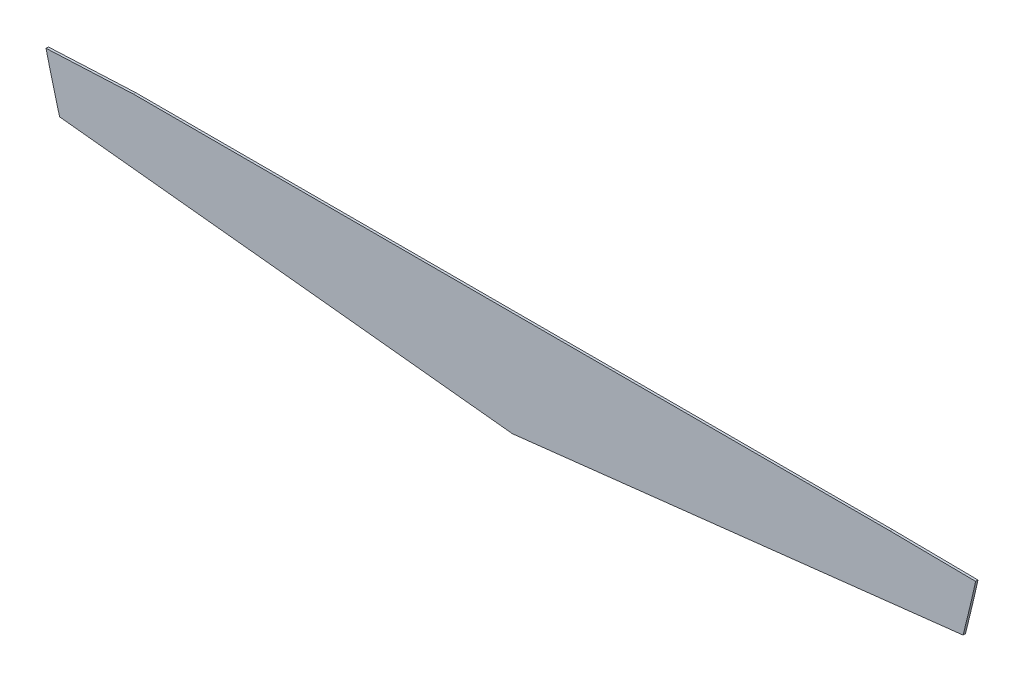
ISO-10303-21;
HEADER;
FILE_DESCRIPTION(('STEP AP214'),'2;1');
FILE_NAME('part.step','',(''),(''),'','','');
FILE_SCHEMA(('AUTOMOTIVE_DESIGN { 1 0 10303 214 1 1 1 1 }'));
ENDSEC;
DATA;
#1=APPLICATION_CONTEXT('core data for automotive mechanical design processes');
#2=APPLICATION_PROTOCOL_DEFINITION('international standard','automotive_design',2000,#1);
#3=PRODUCT_CONTEXT('',#1,'mechanical');
#4=PRODUCT('Part','Part','',(#3));
#5=PRODUCT_RELATED_PRODUCT_CATEGORY('part','',(#4));
#6=PRODUCT_DEFINITION_FORMATION('','',#4);
#7=PRODUCT_DEFINITION_CONTEXT('part definition',#1,'design');
#8=PRODUCT_DEFINITION('design','',#6,#7);
#9=PRODUCT_DEFINITION_SHAPE('','',#8);
#10=(LENGTH_UNIT() NAMED_UNIT(*) SI_UNIT(.MILLI.,.METRE.));
#11=(NAMED_UNIT(*) PLANE_ANGLE_UNIT() SI_UNIT($,.RADIAN.));
#12=(NAMED_UNIT(*) SI_UNIT($,.STERADIAN.) SOLID_ANGLE_UNIT());
#13=UNCERTAINTY_MEASURE_WITH_UNIT(LENGTH_MEASURE(1.E-05),#10,'distance_accuracy_value','');
#14=(GEOMETRIC_REPRESENTATION_CONTEXT(3) GLOBAL_UNCERTAINTY_ASSIGNED_CONTEXT((#13)) GLOBAL_UNIT_ASSIGNED_CONTEXT((#10,
#11,#12)) REPRESENTATION_CONTEXT('',''));
#15=CARTESIAN_POINT('',(0.,0.,0.));
#16=DIRECTION('',(0.,0.,1.));
#17=DIRECTION('',(1.,0.,0.));
#18=AXIS2_PLACEMENT_3D('',#15,#16,#17);
#19=CARTESIAN_POINT('',(-28.4150896120811,13.904168483804,0.1));
#20=DIRECTION('',(0.,0.,-1.));
#21=DIRECTION('',(-1.,0.,0.));
#22=AXIS2_PLACEMENT_3D('',#19,#20,#21);
#23=CYLINDRICAL_SURFACE('',#22,81.8994147226646);
#24=CARTESIAN_POINT('',(-28.4150896120811,13.904168483804,0.));
#25=DIRECTION('',(0.,0.,1.));
#26=DIRECTION('',(1.,0.,0.));
#27=AXIS2_PLACEMENT_3D('',#24,#25,#26);
#28=CIRCLE('',#27,81.8994147226646);
#29=CARTESIAN_POINT('',(50.9903790092227,-6.15289224168993,0.));
#30=VERTEX_POINT('',#29);
#31=CARTESIAN_POINT('',(51.5213649697577,-3.91933736663523,0.));
#32=VERTEX_POINT('',#31);
#33=EDGE_CURVE('E123',#30,#32,#28,.T.);
#34=ORIENTED_EDGE('',*,*,#33,.T.);
#35=DIRECTION('',(0.,0.,-1.));
#36=VECTOR('',#35,1.);
#37=CARTESIAN_POINT('',(51.5213649697577,-3.91933736663523,0.1));
#38=LINE('',#37,#36);
#39=CARTESIAN_POINT('',(51.5213649697577,-3.91933736663523,0.1));
#40=VERTEX_POINT('',#39);
#41=EDGE_CURVE('E11',#40,#32,#38,.T.);
#42=ORIENTED_EDGE('',*,*,#41,.F.);
#43=CARTESIAN_POINT('',(-28.4150896120811,13.904168483804,0.1));
#44=DIRECTION('',(0.,0.,1.));
#45=DIRECTION('',(1.,0.,0.));
#46=AXIS2_PLACEMENT_3D('',#43,#44,#45);
#47=CIRCLE('',#46,81.8994147226646);
#48=CARTESIAN_POINT('',(50.9903790092227,-6.15289224168993,0.1));
#49=VERTEX_POINT('',#48);
#50=EDGE_CURVE('E135',#49,#40,#47,.T.);
#51=ORIENTED_EDGE('',*,*,#50,.F.);
#52=DIRECTION('',(0.,0.,-1.));
#53=VECTOR('',#52,1.);
#54=CARTESIAN_POINT('',(50.9903790092227,-6.15289224168993,0.1));
#55=LINE('',#54,#53);
#56=EDGE_CURVE('E119',#49,#30,#55,.T.);
#57=ORIENTED_EDGE('',*,*,#56,.T.);
#58=EDGE_LOOP('',(#34,#42,#51,#57));
#59=FACE_BOUND('',#58,.T.);
#60=ADVANCED_FACE('F33',(#59),#23,.T.);
#61=CARTESIAN_POINT('',(47.9002862949546,-3.88071453500176,0.1));
#62=DIRECTION('',(-0.0106655055876229,-0.99994312187772,0.));
#63=DIRECTION('',(0.99994312187772,-0.0106655055876229,0.));
#64=AXIS2_PLACEMENT_3D('',#61,#62,#63);
#65=PLANE('',#64);
#66=DIRECTION('',(-0.99994312187772,0.0106655055876229,0.));
#67=VECTOR('',#66,1.);
#68=CARTESIAN_POINT('',(47.9002862949546,-3.88071453500176,0.));
#69=LINE('',#68,#67);
#70=CARTESIAN_POINT('',(47.9002862949546,-3.88071453500176,0.));
#71=VERTEX_POINT('',#70);
#72=EDGE_CURVE('E126',#32,#71,#69,.T.);
#73=ORIENTED_EDGE('',*,*,#72,.T.);
#74=DIRECTION('',(0.,0.,-1.));
#75=VECTOR('',#74,1.);
#76=CARTESIAN_POINT('',(47.9002862949546,-3.88071453500176,0.1));
#77=LINE('',#76,#75);
#78=CARTESIAN_POINT('',(47.9002862949546,-3.88071453500176,0.1));
#79=VERTEX_POINT('',#78);
#80=EDGE_CURVE('E41',#79,#71,#77,.T.);
#81=ORIENTED_EDGE('',*,*,#80,.F.);
#82=DIRECTION('',(-0.99994312187772,0.0106655055876229,0.));
#83=VECTOR('',#82,1.);
#84=CARTESIAN_POINT('',(47.9002862949546,-3.88071453500176,0.1));
#85=LINE('',#84,#83);
#86=EDGE_CURVE('E89',#40,#79,#85,.T.);
#87=ORIENTED_EDGE('',*,*,#86,.F.);
#88=ORIENTED_EDGE('',*,*,#41,.T.);
#89=EDGE_LOOP('',(#73,#81,#87,#88));
#90=FACE_BOUND('',#89,.T.);
#91=ADVANCED_FACE('F160',(#90),#65,.F.);
#92=CARTESIAN_POINT('',(47.9002862949546,-3.88071453500176,0.1));
#93=DIRECTION('',(0.,-1.,0.));
#94=DIRECTION('',(0.,0.,-1.));
#95=AXIS2_PLACEMENT_3D('',#92,#93,#94);
#96=PLANE('',#95);
#97=DIRECTION('',(-1.,0.,0.));
#98=VECTOR('',#97,1.);
#99=CARTESIAN_POINT('',(47.9002862949546,-3.88071453500176,0.));
#100=LINE('',#99,#98);
#101=CARTESIAN_POINT('',(15.9002862949545,-3.88071453500176,0.));
#102=VERTEX_POINT('',#101);
#103=EDGE_CURVE('E128',#71,#102,#100,.T.);
#104=ORIENTED_EDGE('',*,*,#103,.T.);
#105=DIRECTION('',(0.,0.,-1.));
#106=VECTOR('',#105,1.);
#107=CARTESIAN_POINT('',(15.9002862949545,-3.88071453500176,0.1));
#108=LINE('',#107,#106);
#109=CARTESIAN_POINT('',(15.9002862949545,-3.88071453500176,0.1));
#110=VERTEX_POINT('',#109);
#111=EDGE_CURVE('E139',#110,#102,#108,.T.);
#112=ORIENTED_EDGE('',*,*,#111,.F.);
#113=DIRECTION('',(-1.,0.,0.));
#114=VECTOR('',#113,1.);
#115=CARTESIAN_POINT('',(47.9002862949546,-3.88071453500176,0.1));
#116=LINE('',#115,#114);
#117=EDGE_CURVE('E147',#79,#110,#116,.T.);
#118=ORIENTED_EDGE('',*,*,#117,.F.);
#119=ORIENTED_EDGE('',*,*,#80,.T.);
#120=EDGE_LOOP('',(#104,#112,#118,#119));
#121=FACE_BOUND('',#120,.T.);
#122=ADVANCED_FACE('F145',(#121),#96,.F.);
#123=CARTESIAN_POINT('',(15.9002862949545,-3.88071453500176,0.1));
#124=DIRECTION('',(0.0464546312392884,-0.99892040085105,0.));
#125=DIRECTION('',(0.99892040085105,0.0464546312392884,0.));
#126=AXIS2_PLACEMENT_3D('',#123,#124,#125);
#127=PLANE('',#126);
#128=DIRECTION('',(-0.99892040085105,-0.0464546312392884,0.));
#129=VECTOR('',#128,1.);
#130=CARTESIAN_POINT('',(15.9002862949545,-3.88071453500176,0.));
#131=LINE('',#130,#129);
#132=CARTESIAN_POINT('',(12.202555869004,-4.05267688877237,0.));
#133=VERTEX_POINT('',#132);
#134=EDGE_CURVE('E130',#102,#133,#131,.T.);
#135=ORIENTED_EDGE('',*,*,#134,.T.);
#136=DIRECTION('',(0.,0.,-1.));
#137=VECTOR('',#136,1.);
#138=CARTESIAN_POINT('',(12.202555869004,-4.05267688877237,0.1));
#139=LINE('',#138,#137);
#140=CARTESIAN_POINT('',(12.202555869004,-4.05267688877237,0.1));
#141=VERTEX_POINT('',#140);
#142=EDGE_CURVE('E114',#141,#133,#139,.T.);
#143=ORIENTED_EDGE('',*,*,#142,.F.);
#144=DIRECTION('',(-0.99892040085105,-0.0464546312392884,0.));
#145=VECTOR('',#144,1.);
#146=CARTESIAN_POINT('',(15.9002862949545,-3.88071453500176,0.1));
#147=LINE('',#146,#145);
#148=EDGE_CURVE('E105',#110,#141,#147,.T.);
#149=ORIENTED_EDGE('',*,*,#148,.F.);
#150=ORIENTED_EDGE('',*,*,#111,.T.);
#151=EDGE_LOOP('',(#135,#143,#149,#150));
#152=FACE_BOUND('',#151,.T.);
#153=ADVANCED_FACE('F153',(#152),#127,.F.);
#154=CARTESIAN_POINT('',(83.1940867794193,13.1331472476457,0.1));
#155=DIRECTION('',(0.,0.,-1.));
#156=DIRECTION('',(-1.,0.,0.));
#157=AXIS2_PLACEMENT_3D('',#154,#155,#156);
#158=CYLINDRICAL_SURFACE('',#157,73.0421112253223);
#159=CARTESIAN_POINT('',(83.1940867794193,13.1331472476457,0.));
#160=DIRECTION('',(0.,0.,1.));
#161=DIRECTION('',(1.,0.,0.));
#162=AXIS2_PLACEMENT_3D('',#159,#160,#161);
#163=CIRCLE('',#162,73.0421112253223);
#164=CARTESIAN_POINT('',(12.7785783153393,-6.2783488306432,0.));
#165=VERTEX_POINT('',#164);
#166=EDGE_CURVE('E113',#133,#165,#163,.T.);
#167=ORIENTED_EDGE('',*,*,#166,.T.);
#168=DIRECTION('',(0.,0.,-1.));
#169=VECTOR('',#168,1.);
#170=CARTESIAN_POINT('',(12.7785783153393,-6.2783488306432,0.1));
#171=LINE('',#170,#169);
#172=CARTESIAN_POINT('',(12.7785783153393,-6.2783488306432,0.1));
#173=VERTEX_POINT('',#172);
#174=EDGE_CURVE('E110',#173,#165,#171,.T.);
#175=ORIENTED_EDGE('',*,*,#174,.F.);
#176=CARTESIAN_POINT('',(83.1940867794193,13.1331472476457,0.1));
#177=DIRECTION('',(0.,0.,1.));
#178=DIRECTION('',(1.,0.,0.));
#179=AXIS2_PLACEMENT_3D('',#176,#177,#178);
#180=CIRCLE('',#179,73.0421112253223);
#181=EDGE_CURVE('E99',#141,#173,#180,.T.);
#182=ORIENTED_EDGE('',*,*,#181,.F.);
#183=ORIENTED_EDGE('',*,*,#142,.T.);
#184=EDGE_LOOP('',(#167,#175,#182,#183));
#185=FACE_BOUND('',#184,.T.);
#186=ADVANCED_FACE('F111',(#185),#158,.T.);
#187=CARTESIAN_POINT('',(12.7785783153393,-6.2783488306432,0.1));
#188=DIRECTION('',(0.105433049502025,0.994426403547645,0.));
#189=DIRECTION('',(-0.994426403547645,0.105433049502025,0.));
#190=AXIS2_PLACEMENT_3D('',#187,#188,#189);
#191=PLANE('',#190);
#192=DIRECTION('',(0.994426403547645,-0.105433049502025,0.));
#193=VECTOR('',#192,1.);
#194=CARTESIAN_POINT('',(12.7785783153393,-6.2783488306432,0.));
#195=LINE('',#194,#193);
#196=CARTESIAN_POINT('',(31.925658705369,-8.30839858332411,0.));
#197=VERTEX_POINT('',#196);
#198=EDGE_CURVE('E75',#165,#197,#195,.T.);
#199=ORIENTED_EDGE('',*,*,#198,.T.);
#200=DIRECTION('',(0.,0.,-1.));
#201=VECTOR('',#200,1.);
#202=CARTESIAN_POINT('',(31.925658705369,-8.30839858332411,0.1));
#203=LINE('',#202,#201);
#204=CARTESIAN_POINT('',(31.925658705369,-8.30839858332411,0.1));
#205=VERTEX_POINT('',#204);
#206=EDGE_CURVE('E115',#205,#197,#203,.T.);
#207=ORIENTED_EDGE('',*,*,#206,.F.);
#208=DIRECTION('',(0.994426403547645,-0.105433049502025,0.));
#209=VECTOR('',#208,1.);
#210=CARTESIAN_POINT('',(12.7785783153393,-6.2783488306432,0.1));
#211=LINE('',#210,#209);
#212=EDGE_CURVE('E103',#173,#205,#211,.T.);
#213=ORIENTED_EDGE('',*,*,#212,.F.);
#214=ORIENTED_EDGE('',*,*,#174,.T.);
#215=EDGE_LOOP('',(#199,#207,#213,#214));
#216=FACE_BOUND('',#215,.T.);
#217=ADVANCED_FACE('F117',(#216),#191,.F.);
#218=CARTESIAN_POINT('',(31.925658705369,-8.30839858332411,0.1));
#219=DIRECTION('',(-0.112346781181777,0.993669059978268,0.));
#220=DIRECTION('',(-0.993669059978268,-0.112346781181777,0.));
#221=AXIS2_PLACEMENT_3D('',#218,#219,#220);
#222=PLANE('',#221);
#223=DIRECTION('',(0.993669059978268,0.112346781181777,0.));
#224=VECTOR('',#223,1.);
#225=CARTESIAN_POINT('',(31.925658705369,-8.30839858332411,0.));
#226=LINE('',#225,#224);
#227=EDGE_CURVE('E81',#197,#30,#226,.T.);
#228=ORIENTED_EDGE('',*,*,#227,.T.);
#229=ORIENTED_EDGE('',*,*,#56,.F.);
#230=DIRECTION('',(0.993669059978268,0.112346781181777,0.));
#231=VECTOR('',#230,1.);
#232=CARTESIAN_POINT('',(31.925658705369,-8.30839858332411,0.1));
#233=LINE('',#232,#231);
#234=EDGE_CURVE('E49',#205,#49,#233,.T.);
#235=ORIENTED_EDGE('',*,*,#234,.F.);
#236=ORIENTED_EDGE('',*,*,#206,.T.);
#237=EDGE_LOOP('',(#228,#229,#235,#236));
#238=FACE_BOUND('',#237,.T.);
#239=ADVANCED_FACE('F174',(#238),#222,.F.);
#240=CARTESIAN_POINT('',(-28.4150896120811,13.904168483804,0.1));
#241=DIRECTION('',(0.,0.,1.));
#242=DIRECTION('',(1.,0.,0.));
#243=AXIS2_PLACEMENT_3D('',#240,#241,#242);
#244=PLANE('',#243);
#245=ORIENTED_EDGE('',*,*,#50,.T.);
#246=ORIENTED_EDGE('',*,*,#86,.T.);
#247=ORIENTED_EDGE('',*,*,#117,.T.);
#248=ORIENTED_EDGE('',*,*,#148,.T.);
#249=ORIENTED_EDGE('',*,*,#181,.T.);
#250=ORIENTED_EDGE('',*,*,#212,.T.);
#251=ORIENTED_EDGE('',*,*,#234,.T.);
#252=EDGE_LOOP('',(#245,#246,#247,#248,#249,#250,#251));
#253=FACE_BOUND('',#252,.T.);
#254=ADVANCED_FACE('F101',(#253),#244,.T.);
#255=CARTESIAN_POINT('',(-28.4150896120811,13.904168483804,0.));
#256=DIRECTION('',(0.,0.,1.));
#257=DIRECTION('',(1.,0.,0.));
#258=AXIS2_PLACEMENT_3D('',#255,#256,#257);
#259=PLANE('',#258);
#260=ORIENTED_EDGE('',*,*,#33,.F.);
#261=ORIENTED_EDGE('',*,*,#227,.F.);
#262=ORIENTED_EDGE('',*,*,#198,.F.);
#263=ORIENTED_EDGE('',*,*,#166,.F.);
#264=ORIENTED_EDGE('',*,*,#134,.F.);
#265=ORIENTED_EDGE('',*,*,#103,.F.);
#266=ORIENTED_EDGE('',*,*,#72,.F.);
#267=EDGE_LOOP('',(#260,#261,#262,#263,#264,#265,#266));
#268=FACE_BOUND('',#267,.T.);
#269=ADVANCED_FACE('F151',(#268),#259,.F.);
#270=CLOSED_SHELL('',(#60,#91,#122,#153,#186,#217,#239,#254,#269));
#271=MANIFOLD_SOLID_BREP('B2',#270);
#272=ADVANCED_BREP_SHAPE_REPRESENTATION('',(#18,#271),#14);
#273=SHAPE_DEFINITION_REPRESENTATION(#9,#272);
ENDSEC;
END-ISO-10303-21;
